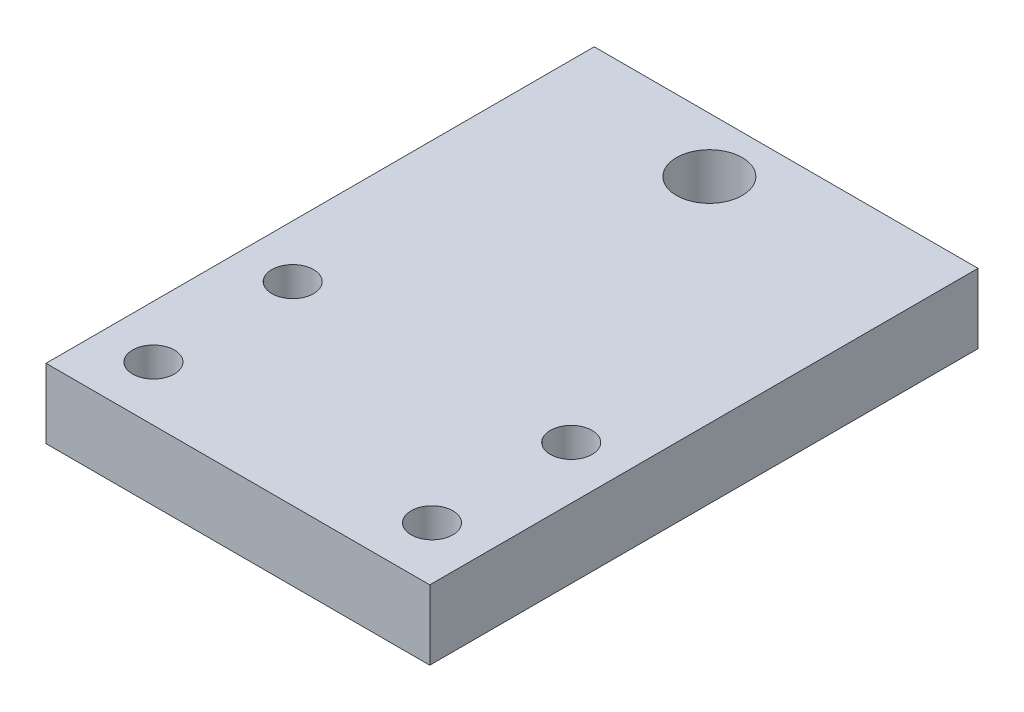
ISO-10303-21;
HEADER;
FILE_DESCRIPTION(('STEP AP214'),'2;1');
FILE_NAME('part.step','',(''),(''),'','','');
FILE_SCHEMA(('AUTOMOTIVE_DESIGN { 1 0 10303 214 1 1 1 1 }'));
ENDSEC;
DATA;
#1=APPLICATION_CONTEXT('core data for automotive mechanical design processes');
#2=APPLICATION_PROTOCOL_DEFINITION('international standard','automotive_design',2000,#1);
#3=PRODUCT_CONTEXT('',#1,'mechanical');
#4=PRODUCT('Part','Part','',(#3));
#5=PRODUCT_RELATED_PRODUCT_CATEGORY('part','',(#4));
#6=PRODUCT_DEFINITION_FORMATION('','',#4);
#7=PRODUCT_DEFINITION_CONTEXT('part definition',#1,'design');
#8=PRODUCT_DEFINITION('design','',#6,#7);
#9=PRODUCT_DEFINITION_SHAPE('','',#8);
#10=(LENGTH_UNIT() NAMED_UNIT(*) SI_UNIT(.MILLI.,.METRE.));
#11=(NAMED_UNIT(*) PLANE_ANGLE_UNIT() SI_UNIT($,.RADIAN.));
#12=(NAMED_UNIT(*) SI_UNIT($,.STERADIAN.) SOLID_ANGLE_UNIT());
#13=UNCERTAINTY_MEASURE_WITH_UNIT(LENGTH_MEASURE(1.E-05),#10,'distance_accuracy_value','');
#14=(GEOMETRIC_REPRESENTATION_CONTEXT(3) GLOBAL_UNCERTAINTY_ASSIGNED_CONTEXT((#13)) GLOBAL_UNIT_ASSIGNED_CONTEXT((#10,
#11,#12)) REPRESENTATION_CONTEXT('',''));
#15=CARTESIAN_POINT('',(0.,0.,0.));
#16=DIRECTION('',(0.,0.,1.));
#17=DIRECTION('',(1.,0.,0.));
#18=AXIS2_PLACEMENT_3D('',#15,#16,#17);
#19=CARTESIAN_POINT('',(35.,6.35,0.));
#20=DIRECTION('',(1.,0.,0.));
#21=DIRECTION('',(0.,0.,-1.));
#22=AXIS2_PLACEMENT_3D('',#19,#20,#21);
#23=PLANE('',#22);
#24=DIRECTION('',(0.,0.,1.));
#25=VECTOR('',#24,1.);
#26=CARTESIAN_POINT('',(35.,0.,0.));
#27=LINE('',#26,#25);
#28=CARTESIAN_POINT('',(35.,0.,-50.));
#29=VERTEX_POINT('',#28);
#30=CARTESIAN_POINT('',(35.,0.,0.));
#31=VERTEX_POINT('',#30);
#32=EDGE_CURVE('E141',#29,#31,#27,.T.);
#33=ORIENTED_EDGE('',*,*,#32,.F.);
#34=DIRECTION('',(0.,-1.,0.));
#35=VECTOR('',#34,1.);
#36=CARTESIAN_POINT('',(35.,6.35,-50.));
#37=LINE('',#36,#35);
#38=CARTESIAN_POINT('',(35.,6.35,-50.));
#39=VERTEX_POINT('',#38);
#40=EDGE_CURVE('E11',#39,#29,#37,.T.);
#41=ORIENTED_EDGE('',*,*,#40,.F.);
#42=DIRECTION('',(0.,0.,1.));
#43=VECTOR('',#42,1.);
#44=CARTESIAN_POINT('',(35.,6.35,0.));
#45=LINE('',#44,#43);
#46=CARTESIAN_POINT('',(35.,6.35,0.));
#47=VERTEX_POINT('',#46);
#48=EDGE_CURVE('E111',#39,#47,#45,.T.);
#49=ORIENTED_EDGE('',*,*,#48,.T.);
#50=DIRECTION('',(0.,-1.,0.));
#51=VECTOR('',#50,1.);
#52=CARTESIAN_POINT('',(35.,6.35,0.));
#53=LINE('',#52,#51);
#54=EDGE_CURVE('E88',#47,#31,#53,.T.);
#55=ORIENTED_EDGE('',*,*,#54,.T.);
#56=EDGE_LOOP('',(#33,#41,#49,#55));
#57=FACE_BOUND('',#56,.T.);
#58=ADVANCED_FACE('F47',(#57),#23,.T.);
#59=CARTESIAN_POINT('',(0.,6.35,-50.));
#60=DIRECTION('',(0.,0.,-1.));
#61=DIRECTION('',(-1.,0.,0.));
#62=AXIS2_PLACEMENT_3D('',#59,#60,#61);
#63=PLANE('',#62);
#64=DIRECTION('',(1.,0.,0.));
#65=VECTOR('',#64,1.);
#66=CARTESIAN_POINT('',(0.,0.,-50.));
#67=LINE('',#66,#65);
#68=CARTESIAN_POINT('',(0.,0.,-50.));
#69=VERTEX_POINT('',#68);
#70=EDGE_CURVE('E100',#69,#29,#67,.T.);
#71=ORIENTED_EDGE('',*,*,#70,.F.);
#72=DIRECTION('',(0.,-1.,0.));
#73=VECTOR('',#72,1.);
#74=CARTESIAN_POINT('',(0.,6.35,-50.));
#75=LINE('',#74,#73);
#76=CARTESIAN_POINT('',(0.,6.35,-50.));
#77=VERTEX_POINT('',#76);
#78=EDGE_CURVE('E57',#77,#69,#75,.T.);
#79=ORIENTED_EDGE('',*,*,#78,.F.);
#80=DIRECTION('',(1.,0.,0.));
#81=VECTOR('',#80,1.);
#82=CARTESIAN_POINT('',(0.,6.35,-50.));
#83=LINE('',#82,#81);
#84=EDGE_CURVE('E98',#77,#39,#83,.T.);
#85=ORIENTED_EDGE('',*,*,#84,.T.);
#86=ORIENTED_EDGE('',*,*,#40,.T.);
#87=EDGE_LOOP('',(#71,#79,#85,#86));
#88=FACE_BOUND('',#87,.T.);
#89=ADVANCED_FACE('F96',(#88),#63,.T.);
#90=CARTESIAN_POINT('',(0.,6.35,0.));
#91=DIRECTION('',(1.,0.,0.));
#92=DIRECTION('',(0.,0.,-1.));
#93=AXIS2_PLACEMENT_3D('',#90,#91,#92);
#94=PLANE('',#93);
#95=DIRECTION('',(0.,0.,1.));
#96=VECTOR('',#95,1.);
#97=CARTESIAN_POINT('',(0.,0.,0.));
#98=LINE('',#97,#96);
#99=CARTESIAN_POINT('',(0.,0.,0.));
#100=VERTEX_POINT('',#99);
#101=EDGE_CURVE('E146',#69,#100,#98,.T.);
#102=ORIENTED_EDGE('',*,*,#101,.T.);
#103=DIRECTION('',(0.,-1.,0.));
#104=VECTOR('',#103,1.);
#105=CARTESIAN_POINT('',(0.,6.35,0.));
#106=LINE('',#105,#104);
#107=CARTESIAN_POINT('',(0.,6.35,0.));
#108=VERTEX_POINT('',#107);
#109=EDGE_CURVE('E104',#108,#100,#106,.T.);
#110=ORIENTED_EDGE('',*,*,#109,.F.);
#111=DIRECTION('',(0.,0.,1.));
#112=VECTOR('',#111,1.);
#113=CARTESIAN_POINT('',(0.,6.35,0.));
#114=LINE('',#113,#112);
#115=EDGE_CURVE('E106',#77,#108,#114,.T.);
#116=ORIENTED_EDGE('',*,*,#115,.F.);
#117=ORIENTED_EDGE('',*,*,#78,.T.);
#118=EDGE_LOOP('',(#102,#110,#116,#117));
#119=FACE_BOUND('',#118,.T.);
#120=ADVANCED_FACE('F107',(#119),#94,.F.);
#121=CARTESIAN_POINT('',(4.80000000000001,6.35,-5.));
#122=DIRECTION('',(0.,-1.,0.));
#123=DIRECTION('',(0.,0.,-1.));
#124=AXIS2_PLACEMENT_3D('',#121,#122,#123);
#125=CYLINDRICAL_SURFACE('',#124,1.905);
#126=CARTESIAN_POINT('',(4.80000000000001,6.35,-5.));
#127=DIRECTION('',(0.,1.,0.));
#128=DIRECTION('',(0.,0.,1.));
#129=AXIS2_PLACEMENT_3D('',#126,#127,#128);
#130=CIRCLE('',#129,1.905);
#131=CARTESIAN_POINT('',(4.80000000000001,6.35,-3.095));
#132=VERTEX_POINT('',#131);
#133=EDGE_CURVE('E115',#132,#132,#130,.T.);
#134=ORIENTED_EDGE('',*,*,#133,.T.);
#135=EDGE_LOOP('',(#134));
#136=FACE_BOUND('',#135,.T.);
#137=CARTESIAN_POINT('',(4.80000000000001,0.,-5.));
#138=DIRECTION('',(0.,1.,0.));
#139=DIRECTION('',(0.,0.,1.));
#140=AXIS2_PLACEMENT_3D('',#137,#138,#139);
#141=CIRCLE('',#140,1.905);
#142=CARTESIAN_POINT('',(4.80000000000001,0.,-3.095));
#143=VERTEX_POINT('',#142);
#144=EDGE_CURVE('E137',#143,#143,#141,.T.);
#145=ORIENTED_EDGE('',*,*,#144,.F.);
#146=EDGE_LOOP('',(#145));
#147=FACE_BOUND('',#146,.T.);
#148=ADVANCED_FACE('F166',(#136,#147),#125,.F.);
#149=CARTESIAN_POINT('',(30.2,6.35,-5.));
#150=DIRECTION('',(0.,-1.,0.));
#151=DIRECTION('',(0.,0.,-1.));
#152=AXIS2_PLACEMENT_3D('',#149,#150,#151);
#153=CYLINDRICAL_SURFACE('',#152,1.90500000000001);
#154=CARTESIAN_POINT('',(30.2,6.35,-5.));
#155=DIRECTION('',(0.,1.,0.));
#156=DIRECTION('',(0.,0.,1.));
#157=AXIS2_PLACEMENT_3D('',#154,#155,#156);
#158=CIRCLE('',#157,1.90500000000001);
#159=CARTESIAN_POINT('',(30.2,6.35,-3.09499999999999));
#160=VERTEX_POINT('',#159);
#161=EDGE_CURVE('E283',#160,#160,#158,.T.);
#162=ORIENTED_EDGE('',*,*,#161,.T.);
#163=EDGE_LOOP('',(#162));
#164=FACE_BOUND('',#163,.T.);
#165=CARTESIAN_POINT('',(30.2,0.,-5.));
#166=DIRECTION('',(0.,1.,0.));
#167=DIRECTION('',(0.,0.,1.));
#168=AXIS2_PLACEMENT_3D('',#165,#166,#167);
#169=CIRCLE('',#168,1.90500000000001);
#170=CARTESIAN_POINT('',(30.2,0.,-3.09499999999999));
#171=VERTEX_POINT('',#170);
#172=EDGE_CURVE('E133',#171,#171,#169,.T.);
#173=ORIENTED_EDGE('',*,*,#172,.F.);
#174=EDGE_LOOP('',(#173));
#175=FACE_BOUND('',#174,.T.);
#176=ADVANCED_FACE('F169',(#164,#175),#153,.F.);
#177=CARTESIAN_POINT('',(4.8,6.35,-17.7));
#178=DIRECTION('',(0.,-1.,0.));
#179=DIRECTION('',(0.,0.,-1.));
#180=AXIS2_PLACEMENT_3D('',#177,#178,#179);
#181=CYLINDRICAL_SURFACE('',#180,1.905);
#182=CARTESIAN_POINT('',(4.8,6.35,-17.7));
#183=DIRECTION('',(0.,1.,0.));
#184=DIRECTION('',(0.,0.,1.));
#185=AXIS2_PLACEMENT_3D('',#182,#183,#184);
#186=CIRCLE('',#185,1.905);
#187=CARTESIAN_POINT('',(4.8,6.35,-15.795));
#188=VERTEX_POINT('',#187);
#189=EDGE_CURVE('E279',#188,#188,#186,.T.);
#190=ORIENTED_EDGE('',*,*,#189,.T.);
#191=EDGE_LOOP('',(#190));
#192=FACE_BOUND('',#191,.T.);
#193=CARTESIAN_POINT('',(4.8,0.,-17.7));
#194=DIRECTION('',(0.,1.,0.));
#195=DIRECTION('',(0.,0.,1.));
#196=AXIS2_PLACEMENT_3D('',#193,#194,#195);
#197=CIRCLE('',#196,1.905);
#198=CARTESIAN_POINT('',(4.8,0.,-15.795));
#199=VERTEX_POINT('',#198);
#200=EDGE_CURVE('E129',#199,#199,#197,.T.);
#201=ORIENTED_EDGE('',*,*,#200,.F.);
#202=EDGE_LOOP('',(#201));
#203=FACE_BOUND('',#202,.T.);
#204=ADVANCED_FACE('F173',(#192,#203),#181,.F.);
#205=CARTESIAN_POINT('',(30.2,6.35,-17.7));
#206=DIRECTION('',(0.,-1.,0.));
#207=DIRECTION('',(0.,0.,-1.));
#208=AXIS2_PLACEMENT_3D('',#205,#206,#207);
#209=CYLINDRICAL_SURFACE('',#208,1.905);
#210=CARTESIAN_POINT('',(30.2,6.35,-17.7));
#211=DIRECTION('',(0.,1.,0.));
#212=DIRECTION('',(0.,0.,1.));
#213=AXIS2_PLACEMENT_3D('',#210,#211,#212);
#214=CIRCLE('',#213,1.905);
#215=CARTESIAN_POINT('',(30.2,6.35,-15.795));
#216=VERTEX_POINT('',#215);
#217=EDGE_CURVE('E187',#216,#216,#214,.T.);
#218=ORIENTED_EDGE('',*,*,#217,.T.);
#219=EDGE_LOOP('',(#218));
#220=FACE_BOUND('',#219,.T.);
#221=CARTESIAN_POINT('',(30.2,0.,-17.7));
#222=DIRECTION('',(0.,1.,0.));
#223=DIRECTION('',(0.,0.,1.));
#224=AXIS2_PLACEMENT_3D('',#221,#222,#223);
#225=CIRCLE('',#224,1.905);
#226=CARTESIAN_POINT('',(30.2,0.,-15.795));
#227=VERTEX_POINT('',#226);
#228=EDGE_CURVE('E125',#227,#227,#225,.T.);
#229=ORIENTED_EDGE('',*,*,#228,.F.);
#230=EDGE_LOOP('',(#229));
#231=FACE_BOUND('',#230,.T.);
#232=ADVANCED_FACE('F176',(#220,#231),#209,.F.);
#233=CARTESIAN_POINT('',(15.5,6.35,-45.));
#234=DIRECTION('',(0.,-1.,0.));
#235=DIRECTION('',(0.,0.,-1.));
#236=AXIS2_PLACEMENT_3D('',#233,#234,#235);
#237=CYLINDRICAL_SURFACE('',#236,3.);
#238=CARTESIAN_POINT('',(15.5,6.35,-45.));
#239=DIRECTION('',(0.,1.,0.));
#240=DIRECTION('',(0.,0.,1.));
#241=AXIS2_PLACEMENT_3D('',#238,#239,#240);
#242=CIRCLE('',#241,3.);
#243=CARTESIAN_POINT('',(15.5,6.35,-42.));
#244=VERTEX_POINT('',#243);
#245=EDGE_CURVE('E151',#244,#244,#242,.T.);
#246=ORIENTED_EDGE('',*,*,#245,.T.);
#247=EDGE_LOOP('',(#246));
#248=FACE_BOUND('',#247,.T.);
#249=CARTESIAN_POINT('',(15.5,0.,-45.));
#250=DIRECTION('',(0.,1.,0.));
#251=DIRECTION('',(0.,0.,1.));
#252=AXIS2_PLACEMENT_3D('',#249,#250,#251);
#253=CIRCLE('',#252,3.);
#254=CARTESIAN_POINT('',(15.5,0.,-42.));
#255=VERTEX_POINT('',#254);
#256=EDGE_CURVE('E121',#255,#255,#253,.T.);
#257=ORIENTED_EDGE('',*,*,#256,.F.);
#258=EDGE_LOOP('',(#257));
#259=FACE_BOUND('',#258,.T.);
#260=ADVANCED_FACE('F49',(#248,#259),#237,.F.);
#261=CARTESIAN_POINT('',(0.,6.35,0.));
#262=DIRECTION('',(0.,0.,-1.));
#263=DIRECTION('',(-1.,0.,0.));
#264=AXIS2_PLACEMENT_3D('',#261,#262,#263);
#265=PLANE('',#264);
#266=DIRECTION('',(1.,0.,0.));
#267=VECTOR('',#266,1.);
#268=CARTESIAN_POINT('',(0.,0.,0.));
#269=LINE('',#268,#267);
#270=EDGE_CURVE('E81',#100,#31,#269,.T.);
#271=ORIENTED_EDGE('',*,*,#270,.T.);
#272=ORIENTED_EDGE('',*,*,#54,.F.);
#273=DIRECTION('',(1.,0.,0.));
#274=VECTOR('',#273,1.);
#275=CARTESIAN_POINT('',(0.,6.35,0.));
#276=LINE('',#275,#274);
#277=EDGE_CURVE('E65',#108,#47,#276,.T.);
#278=ORIENTED_EDGE('',*,*,#277,.F.);
#279=ORIENTED_EDGE('',*,*,#109,.T.);
#280=EDGE_LOOP('',(#271,#272,#278,#279));
#281=FACE_BOUND('',#280,.T.);
#282=ADVANCED_FACE('F156',(#281),#265,.F.);
#283=CARTESIAN_POINT('',(0.,6.35,0.));
#284=DIRECTION('',(0.,1.,0.));
#285=DIRECTION('',(0.,0.,1.));
#286=AXIS2_PLACEMENT_3D('',#283,#284,#285);
#287=PLANE('',#286);
#288=ORIENTED_EDGE('',*,*,#245,.F.);
#289=EDGE_LOOP('',(#288));
#290=FACE_BOUND('',#289,.T.);
#291=ORIENTED_EDGE('',*,*,#217,.F.);
#292=EDGE_LOOP('',(#291));
#293=FACE_BOUND('',#292,.T.);
#294=ORIENTED_EDGE('',*,*,#189,.F.);
#295=EDGE_LOOP('',(#294));
#296=FACE_BOUND('',#295,.T.);
#297=ORIENTED_EDGE('',*,*,#161,.F.);
#298=EDGE_LOOP('',(#297));
#299=FACE_BOUND('',#298,.T.);
#300=ORIENTED_EDGE('',*,*,#133,.F.);
#301=EDGE_LOOP('',(#300));
#302=FACE_BOUND('',#301,.T.);
#303=ORIENTED_EDGE('',*,*,#48,.F.);
#304=ORIENTED_EDGE('',*,*,#84,.F.);
#305=ORIENTED_EDGE('',*,*,#115,.T.);
#306=ORIENTED_EDGE('',*,*,#277,.T.);
#307=EDGE_LOOP('',(#303,#304,#305,#306));
#308=FACE_BOUND('',#307,.T.);
#309=ADVANCED_FACE('F110',(#290,#293,#296,#299,#302,#308),#287,.T.);
#310=CARTESIAN_POINT('',(0.,0.,0.));
#311=DIRECTION('',(0.,1.,0.));
#312=DIRECTION('',(0.,0.,1.));
#313=AXIS2_PLACEMENT_3D('',#310,#311,#312);
#314=PLANE('',#313);
#315=ORIENTED_EDGE('',*,*,#256,.T.);
#316=EDGE_LOOP('',(#315));
#317=FACE_BOUND('',#316,.T.);
#318=ORIENTED_EDGE('',*,*,#228,.T.);
#319=EDGE_LOOP('',(#318));
#320=FACE_BOUND('',#319,.T.);
#321=ORIENTED_EDGE('',*,*,#200,.T.);
#322=EDGE_LOOP('',(#321));
#323=FACE_BOUND('',#322,.T.);
#324=ORIENTED_EDGE('',*,*,#172,.T.);
#325=EDGE_LOOP('',(#324));
#326=FACE_BOUND('',#325,.T.);
#327=ORIENTED_EDGE('',*,*,#144,.T.);
#328=EDGE_LOOP('',(#327));
#329=FACE_BOUND('',#328,.T.);
#330=ORIENTED_EDGE('',*,*,#32,.T.);
#331=ORIENTED_EDGE('',*,*,#270,.F.);
#332=ORIENTED_EDGE('',*,*,#101,.F.);
#333=ORIENTED_EDGE('',*,*,#70,.T.);
#334=EDGE_LOOP('',(#330,#331,#332,#333));
#335=FACE_BOUND('',#334,.T.);
#336=ADVANCED_FACE('F157',(#317,#320,#323,#326,#329,#335),#314,.F.);
#337=CLOSED_SHELL('',(#58,#89,#120,#148,#176,#204,#232,#260,#282,#309,#336));
#338=MANIFOLD_SOLID_BREP('B2',#337);
#339=ADVANCED_BREP_SHAPE_REPRESENTATION('',(#18,#338),#14);
#340=SHAPE_DEFINITION_REPRESENTATION(#9,#339);
ENDSEC;
END-ISO-10303-21;
